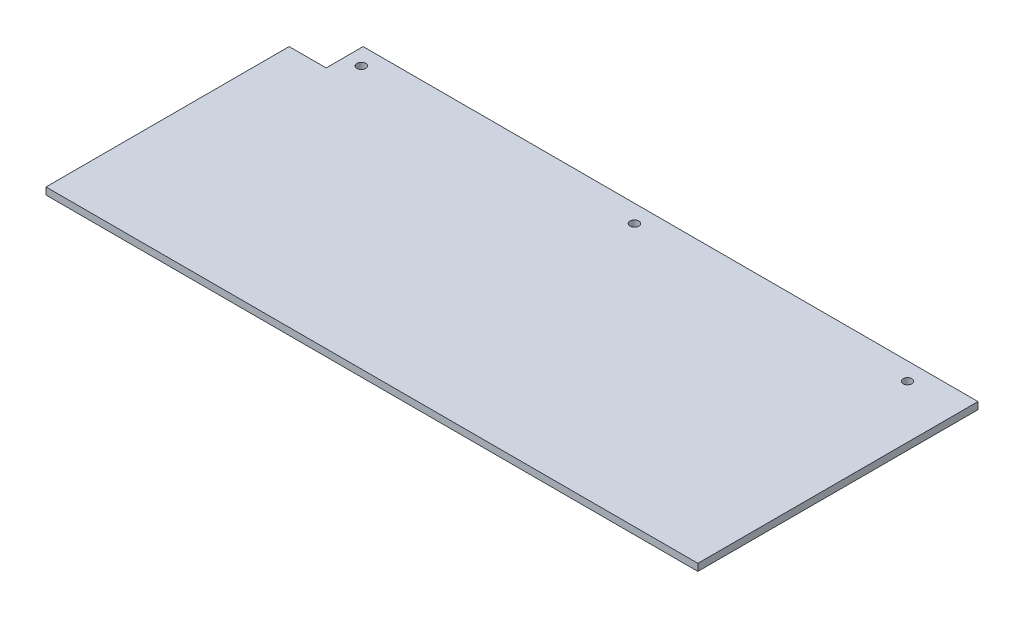
ISO-10303-21;
HEADER;
FILE_DESCRIPTION(('STEP AP214'),'2;1');
FILE_NAME('part.step','',(''),(''),'','','');
FILE_SCHEMA(('AUTOMOTIVE_DESIGN { 1 0 10303 214 1 1 1 1 }'));
ENDSEC;
DATA;
#1=APPLICATION_CONTEXT('core data for automotive mechanical design processes');
#2=APPLICATION_PROTOCOL_DEFINITION('international standard','automotive_design',2000,#1);
#3=PRODUCT_CONTEXT('',#1,'mechanical');
#4=PRODUCT('Part','Part','',(#3));
#5=PRODUCT_RELATED_PRODUCT_CATEGORY('part','',(#4));
#6=PRODUCT_DEFINITION_FORMATION('','',#4);
#7=PRODUCT_DEFINITION_CONTEXT('part definition',#1,'design');
#8=PRODUCT_DEFINITION('design','',#6,#7);
#9=PRODUCT_DEFINITION_SHAPE('','',#8);
#10=(LENGTH_UNIT() NAMED_UNIT(*) SI_UNIT(.MILLI.,.METRE.));
#11=(NAMED_UNIT(*) PLANE_ANGLE_UNIT() SI_UNIT($,.RADIAN.));
#12=(NAMED_UNIT(*) SI_UNIT($,.STERADIAN.) SOLID_ANGLE_UNIT());
#13=UNCERTAINTY_MEASURE_WITH_UNIT(LENGTH_MEASURE(1.E-05),#10,'distance_accuracy_value','');
#14=(GEOMETRIC_REPRESENTATION_CONTEXT(3) GLOBAL_UNCERTAINTY_ASSIGNED_CONTEXT((#13)) GLOBAL_UNIT_ASSIGNED_CONTEXT((#10,
#11,#12)) REPRESENTATION_CONTEXT('',''));
#15=CARTESIAN_POINT('',(0.,0.,0.));
#16=DIRECTION('',(0.,0.,1.));
#17=DIRECTION('',(1.,0.,0.));
#18=AXIS2_PLACEMENT_3D('',#15,#16,#17);
#19=CARTESIAN_POINT('',(0.,4.,0.));
#20=DIRECTION('',(0.,1.,0.));
#21=DIRECTION('',(0.,0.,1.));
#22=AXIS2_PLACEMENT_3D('',#19,#20,#21);
#23=PLANE('',#22);
#24=CARTESIAN_POINT('',(155.,4.,-80.0000000000001));
#25=DIRECTION('',(0.,1.,0.));
#26=DIRECTION('',(0.,0.,-1.));
#27=AXIS2_PLACEMENT_3D('',#24,#25,#26);
#28=CIRCLE('',#27,2.5);
#29=CARTESIAN_POINT('',(155.,4.,-82.5000000000001));
#30=VERTEX_POINT('',#29);
#31=EDGE_CURVE('E175',#30,#30,#28,.T.);
#32=ORIENTED_EDGE('',*,*,#31,.F.);
#33=EDGE_LOOP('',(#32));
#34=FACE_BOUND('',#33,.T.);
#35=DIRECTION('',(0.,0.,-1.));
#36=VECTOR('',#35,1.);
#37=CARTESIAN_POINT('',(185.,4.,-90.0000000000001));
#38=LINE('',#37,#36);
#39=CARTESIAN_POINT('',(185.,4.,69.));
#40=VERTEX_POINT('',#39);
#41=CARTESIAN_POINT('',(185.,4.,-90.0000000000001));
#42=VERTEX_POINT('',#41);
#43=EDGE_CURVE('E148',#40,#42,#38,.T.);
#44=ORIENTED_EDGE('',*,*,#43,.T.);
#45=DIRECTION('',(-1.,0.,0.));
#46=VECTOR('',#45,1.);
#47=CARTESIAN_POINT('',(-164.,4.,-90.));
#48=LINE('',#47,#46);
#49=CARTESIAN_POINT('',(-164.,4.,-90.));
#50=VERTEX_POINT('',#49);
#51=EDGE_CURVE('E92',#42,#50,#48,.T.);
#52=ORIENTED_EDGE('',*,*,#51,.T.);
#53=DIRECTION('',(0.,0.,1.));
#54=VECTOR('',#53,1.);
#55=CARTESIAN_POINT('',(-164.,4.,-90.));
#56=LINE('',#55,#54);
#57=CARTESIAN_POINT('',(-164.,4.,-69.));
#58=VERTEX_POINT('',#57);
#59=EDGE_CURVE('E106',#50,#58,#56,.T.);
#60=ORIENTED_EDGE('',*,*,#59,.T.);
#61=DIRECTION('',(-1.,0.,0.));
#62=VECTOR('',#61,1.);
#63=CARTESIAN_POINT('',(-185.,4.,-69.));
#64=LINE('',#63,#62);
#65=CARTESIAN_POINT('',(-185.,4.,-69.));
#66=VERTEX_POINT('',#65);
#67=EDGE_CURVE('E99',#58,#66,#64,.T.);
#68=ORIENTED_EDGE('',*,*,#67,.T.);
#69=DIRECTION('',(0.,0.,1.));
#70=VECTOR('',#69,1.);
#71=CARTESIAN_POINT('',(-185.,4.,68.9999999999999));
#72=LINE('',#71,#70);
#73=CARTESIAN_POINT('',(-185.,4.,68.9999999999999));
#74=VERTEX_POINT('',#73);
#75=EDGE_CURVE('E103',#66,#74,#72,.T.);
#76=ORIENTED_EDGE('',*,*,#75,.T.);
#77=DIRECTION('',(1.,0.,0.));
#78=VECTOR('',#77,1.);
#79=CARTESIAN_POINT('',(-185.,4.,68.9999999999999));
#80=LINE('',#79,#78);
#81=EDGE_CURVE('E57',#74,#40,#80,.T.);
#82=ORIENTED_EDGE('',*,*,#81,.T.);
#83=EDGE_LOOP('',(#44,#52,#60,#68,#76,#82));
#84=FACE_BOUND('',#83,.T.);
#85=CARTESIAN_POINT('',(-155.,4.,-80.));
#86=DIRECTION('',(0.,1.,0.));
#87=DIRECTION('',(0.,0.,1.));
#88=AXIS2_PLACEMENT_3D('',#85,#86,#87);
#89=CIRCLE('',#88,2.5);
#90=CARTESIAN_POINT('',(-155.,4.,-77.5));
#91=VERTEX_POINT('',#90);
#92=EDGE_CURVE('E135',#91,#91,#89,.T.);
#93=ORIENTED_EDGE('',*,*,#92,.F.);
#94=EDGE_LOOP('',(#93));
#95=FACE_BOUND('',#94,.T.);
#96=CARTESIAN_POINT('',(0.,4.,-80.));
#97=DIRECTION('',(0.,1.,0.));
#98=DIRECTION('',(0.,0.,1.));
#99=AXIS2_PLACEMENT_3D('',#96,#97,#98);
#100=CIRCLE('',#99,2.5);
#101=CARTESIAN_POINT('',(0.,4.,-77.5));
#102=VERTEX_POINT('',#101);
#103=EDGE_CURVE('E183',#102,#102,#100,.T.);
#104=ORIENTED_EDGE('',*,*,#103,.F.);
#105=EDGE_LOOP('',(#104));
#106=FACE_BOUND('',#105,.T.);
#107=ADVANCED_FACE('F39',(#34,#84,#95,#106),#23,.T.);
#108=CARTESIAN_POINT('',(0.,0.,0.));
#109=DIRECTION('',(0.,1.,0.));
#110=DIRECTION('',(0.,0.,1.));
#111=AXIS2_PLACEMENT_3D('',#108,#109,#110);
#112=PLANE('',#111);
#113=DIRECTION('',(0.,0.,-1.));
#114=VECTOR('',#113,1.);
#115=CARTESIAN_POINT('',(185.,0.,-90.0000000000001));
#116=LINE('',#115,#114);
#117=CARTESIAN_POINT('',(185.,0.,69.));
#118=VERTEX_POINT('',#117);
#119=CARTESIAN_POINT('',(185.,0.,-90.0000000000001));
#120=VERTEX_POINT('',#119);
#121=EDGE_CURVE('E130',#118,#120,#116,.T.);
#122=ORIENTED_EDGE('',*,*,#121,.F.);
#123=DIRECTION('',(1.,0.,0.));
#124=VECTOR('',#123,1.);
#125=CARTESIAN_POINT('',(-164.,0.,69.));
#126=LINE('',#125,#124);
#127=CARTESIAN_POINT('',(-185.,0.,68.9999999999999));
#128=VERTEX_POINT('',#127);
#129=EDGE_CURVE('E80',#128,#118,#126,.T.);
#130=ORIENTED_EDGE('',*,*,#129,.F.);
#131=DIRECTION('',(0.,0.,1.));
#132=VECTOR('',#131,1.);
#133=CARTESIAN_POINT('',(-185.,0.,68.9999999999999));
#134=LINE('',#133,#132);
#135=CARTESIAN_POINT('',(-185.,0.,-69.));
#136=VERTEX_POINT('',#135);
#137=EDGE_CURVE('E143',#136,#128,#134,.T.);
#138=ORIENTED_EDGE('',*,*,#137,.F.);
#139=DIRECTION('',(-1.,0.,0.));
#140=VECTOR('',#139,1.);
#141=CARTESIAN_POINT('',(-185.,0.,-69.));
#142=LINE('',#141,#140);
#143=CARTESIAN_POINT('',(-164.,0.,-69.));
#144=VERTEX_POINT('',#143);
#145=EDGE_CURVE('E116',#144,#136,#142,.T.);
#146=ORIENTED_EDGE('',*,*,#145,.F.);
#147=DIRECTION('',(0.,0.,1.));
#148=VECTOR('',#147,1.);
#149=CARTESIAN_POINT('',(-164.,0.,-90.));
#150=LINE('',#149,#148);
#151=CARTESIAN_POINT('',(-164.,0.,-90.));
#152=VERTEX_POINT('',#151);
#153=EDGE_CURVE('E138',#152,#144,#150,.T.);
#154=ORIENTED_EDGE('',*,*,#153,.F.);
#155=DIRECTION('',(-1.,0.,0.));
#156=VECTOR('',#155,1.);
#157=CARTESIAN_POINT('',(-164.,0.,-90.));
#158=LINE('',#157,#156);
#159=EDGE_CURVE('E134',#120,#152,#158,.T.);
#160=ORIENTED_EDGE('',*,*,#159,.F.);
#161=EDGE_LOOP('',(#122,#130,#138,#146,#154,#160));
#162=FACE_BOUND('',#161,.T.);
#163=CARTESIAN_POINT('',(-155.,0.,-80.));
#164=DIRECTION('',(0.,1.,0.));
#165=DIRECTION('',(0.,0.,1.));
#166=AXIS2_PLACEMENT_3D('',#163,#164,#165);
#167=CIRCLE('',#166,2.5);
#168=CARTESIAN_POINT('',(-155.,0.,-77.5));
#169=VERTEX_POINT('',#168);
#170=EDGE_CURVE('E170',#169,#169,#167,.T.);
#171=ORIENTED_EDGE('',*,*,#170,.T.);
#172=EDGE_LOOP('',(#171));
#173=FACE_BOUND('',#172,.T.);
#174=CARTESIAN_POINT('',(155.,0.,-80.0000000000001));
#175=DIRECTION('',(0.,1.,0.));
#176=DIRECTION('',(0.,0.,-1.));
#177=AXIS2_PLACEMENT_3D('',#174,#175,#176);
#178=CIRCLE('',#177,2.5);
#179=CARTESIAN_POINT('',(155.,0.,-82.5000000000001));
#180=VERTEX_POINT('',#179);
#181=EDGE_CURVE('E179',#180,#180,#178,.T.);
#182=ORIENTED_EDGE('',*,*,#181,.T.);
#183=EDGE_LOOP('',(#182));
#184=FACE_BOUND('',#183,.T.);
#185=CARTESIAN_POINT('',(0.,0.,-80.));
#186=DIRECTION('',(0.,1.,0.));
#187=DIRECTION('',(0.,0.,1.));
#188=AXIS2_PLACEMENT_3D('',#185,#186,#187);
#189=CIRCLE('',#188,2.5);
#190=CARTESIAN_POINT('',(0.,0.,-77.5));
#191=VERTEX_POINT('',#190);
#192=EDGE_CURVE('E187',#191,#191,#189,.T.);
#193=ORIENTED_EDGE('',*,*,#192,.T.);
#194=EDGE_LOOP('',(#193));
#195=FACE_BOUND('',#194,.T.);
#196=ADVANCED_FACE('F159',(#162,#173,#184,#195),#112,.F.);
#197=CARTESIAN_POINT('',(185.,4.,-90.0000000000001));
#198=DIRECTION('',(-1.,0.,0.));
#199=DIRECTION('',(0.,0.,1.));
#200=AXIS2_PLACEMENT_3D('',#197,#198,#199);
#201=PLANE('',#200);
#202=ORIENTED_EDGE('',*,*,#121,.T.);
#203=DIRECTION('',(0.,-1.,0.));
#204=VECTOR('',#203,1.);
#205=CARTESIAN_POINT('',(185.,4.,-90.0000000000001));
#206=LINE('',#205,#204);
#207=EDGE_CURVE('E11',#42,#120,#206,.T.);
#208=ORIENTED_EDGE('',*,*,#207,.F.);
#209=ORIENTED_EDGE('',*,*,#43,.F.);
#210=DIRECTION('',(0.,-1.,0.));
#211=VECTOR('',#210,1.);
#212=CARTESIAN_POINT('',(185.,4.,69.));
#213=LINE('',#212,#211);
#214=EDGE_CURVE('E126',#40,#118,#213,.T.);
#215=ORIENTED_EDGE('',*,*,#214,.T.);
#216=EDGE_LOOP('',(#202,#208,#209,#215));
#217=FACE_BOUND('',#216,.T.);
#218=ADVANCED_FACE('F41',(#217),#201,.F.);
#219=CARTESIAN_POINT('',(-164.,4.,-90.));
#220=DIRECTION('',(0.,0.,1.));
#221=DIRECTION('',(1.,0.,0.));
#222=AXIS2_PLACEMENT_3D('',#219,#220,#221);
#223=PLANE('',#222);
#224=ORIENTED_EDGE('',*,*,#159,.T.);
#225=DIRECTION('',(0.,-1.,0.));
#226=VECTOR('',#225,1.);
#227=CARTESIAN_POINT('',(-164.,4.,-90.));
#228=LINE('',#227,#226);
#229=EDGE_CURVE('E49',#50,#152,#228,.T.);
#230=ORIENTED_EDGE('',*,*,#229,.F.);
#231=ORIENTED_EDGE('',*,*,#51,.F.);
#232=ORIENTED_EDGE('',*,*,#207,.T.);
#233=EDGE_LOOP('',(#224,#230,#231,#232));
#234=FACE_BOUND('',#233,.T.);
#235=ADVANCED_FACE('F217',(#234),#223,.F.);
#236=CARTESIAN_POINT('',(-164.,4.,-90.));
#237=DIRECTION('',(1.,0.,0.));
#238=DIRECTION('',(0.,0.,-1.));
#239=AXIS2_PLACEMENT_3D('',#236,#237,#238);
#240=PLANE('',#239);
#241=ORIENTED_EDGE('',*,*,#153,.T.);
#242=DIRECTION('',(0.,-1.,0.));
#243=VECTOR('',#242,1.);
#244=CARTESIAN_POINT('',(-164.,4.,-69.));
#245=LINE('',#244,#243);
#246=EDGE_CURVE('E119',#58,#144,#245,.T.);
#247=ORIENTED_EDGE('',*,*,#246,.F.);
#248=ORIENTED_EDGE('',*,*,#59,.F.);
#249=ORIENTED_EDGE('',*,*,#229,.T.);
#250=EDGE_LOOP('',(#241,#247,#248,#249));
#251=FACE_BOUND('',#250,.T.);
#252=ADVANCED_FACE('F158',(#251),#240,.F.);
#253=CARTESIAN_POINT('',(-185.,4.,-69.));
#254=DIRECTION('',(0.,0.,1.));
#255=DIRECTION('',(1.,0.,0.));
#256=AXIS2_PLACEMENT_3D('',#253,#254,#255);
#257=PLANE('',#256);
#258=ORIENTED_EDGE('',*,*,#145,.T.);
#259=DIRECTION('',(0.,-1.,0.));
#260=VECTOR('',#259,1.);
#261=CARTESIAN_POINT('',(-185.,4.,-69.));
#262=LINE('',#261,#260);
#263=EDGE_CURVE('E113',#66,#136,#262,.T.);
#264=ORIENTED_EDGE('',*,*,#263,.F.);
#265=ORIENTED_EDGE('',*,*,#67,.F.);
#266=ORIENTED_EDGE('',*,*,#246,.T.);
#267=EDGE_LOOP('',(#258,#264,#265,#266));
#268=FACE_BOUND('',#267,.T.);
#269=ADVANCED_FACE('F114',(#268),#257,.F.);
#270=CARTESIAN_POINT('',(-185.,4.,68.9999999999999));
#271=DIRECTION('',(1.,0.,0.));
#272=DIRECTION('',(0.,0.,-1.));
#273=AXIS2_PLACEMENT_3D('',#270,#271,#272);
#274=PLANE('',#273);
#275=ORIENTED_EDGE('',*,*,#137,.T.);
#276=DIRECTION('',(0.,-1.,0.));
#277=VECTOR('',#276,1.);
#278=CARTESIAN_POINT('',(-185.,4.,68.9999999999999));
#279=LINE('',#278,#277);
#280=EDGE_CURVE('E120',#74,#128,#279,.T.);
#281=ORIENTED_EDGE('',*,*,#280,.F.);
#282=ORIENTED_EDGE('',*,*,#75,.F.);
#283=ORIENTED_EDGE('',*,*,#263,.T.);
#284=EDGE_LOOP('',(#275,#281,#282,#283));
#285=FACE_BOUND('',#284,.T.);
#286=ADVANCED_FACE('F122',(#285),#274,.F.);
#287=CARTESIAN_POINT('',(-164.,4.,69.));
#288=DIRECTION('',(0.,0.,-1.));
#289=DIRECTION('',(-1.,0.,0.));
#290=AXIS2_PLACEMENT_3D('',#287,#288,#289);
#291=PLANE('',#290);
#292=ORIENTED_EDGE('',*,*,#129,.T.);
#293=ORIENTED_EDGE('',*,*,#214,.F.);
#294=ORIENTED_EDGE('',*,*,#81,.F.);
#295=ORIENTED_EDGE('',*,*,#280,.T.);
#296=EDGE_LOOP('',(#292,#293,#294,#295));
#297=FACE_BOUND('',#296,.T.);
#298=ADVANCED_FACE('F161',(#297),#291,.F.);
#299=CARTESIAN_POINT('',(-155.,4.,-80.));
#300=DIRECTION('',(0.,-1.,0.));
#301=DIRECTION('',(0.,0.,-1.));
#302=AXIS2_PLACEMENT_3D('',#299,#300,#301);
#303=CYLINDRICAL_SURFACE('',#302,2.5);
#304=ORIENTED_EDGE('',*,*,#92,.T.);
#305=EDGE_LOOP('',(#304));
#306=FACE_BOUND('',#305,.T.);
#307=ORIENTED_EDGE('',*,*,#170,.F.);
#308=EDGE_LOOP('',(#307));
#309=FACE_BOUND('',#308,.T.);
#310=ADVANCED_FACE('F207',(#306,#309),#303,.F.);
#311=CARTESIAN_POINT('',(155.,4.,-80.0000000000001));
#312=DIRECTION('',(0.,-1.,0.));
#313=DIRECTION('',(0.,0.,-1.));
#314=AXIS2_PLACEMENT_3D('',#311,#312,#313);
#315=CYLINDRICAL_SURFACE('',#314,2.5);
#316=ORIENTED_EDGE('',*,*,#31,.T.);
#317=EDGE_LOOP('',(#316));
#318=FACE_BOUND('',#317,.T.);
#319=ORIENTED_EDGE('',*,*,#181,.F.);
#320=EDGE_LOOP('',(#319));
#321=FACE_BOUND('',#320,.T.);
#322=ADVANCED_FACE('F271',(#318,#321),#315,.F.);
#323=CARTESIAN_POINT('',(0.,4.,-80.));
#324=DIRECTION('',(0.,-1.,0.));
#325=DIRECTION('',(0.,0.,-1.));
#326=AXIS2_PLACEMENT_3D('',#323,#324,#325);
#327=CYLINDRICAL_SURFACE('',#326,2.5);
#328=ORIENTED_EDGE('',*,*,#103,.T.);
#329=EDGE_LOOP('',(#328));
#330=FACE_BOUND('',#329,.T.);
#331=ORIENTED_EDGE('',*,*,#192,.F.);
#332=EDGE_LOOP('',(#331));
#333=FACE_BOUND('',#332,.T.);
#334=ADVANCED_FACE('F195',(#330,#333),#327,.F.);
#335=CLOSED_SHELL('',(#107,#196,#218,#235,#252,#269,#286,#298,#310,#322,#334));
#336=MANIFOLD_SOLID_BREP('B2',#335);
#337=ADVANCED_BREP_SHAPE_REPRESENTATION('',(#18,#336),#14);
#338=SHAPE_DEFINITION_REPRESENTATION(#9,#337);
ENDSEC;
END-ISO-10303-21;
